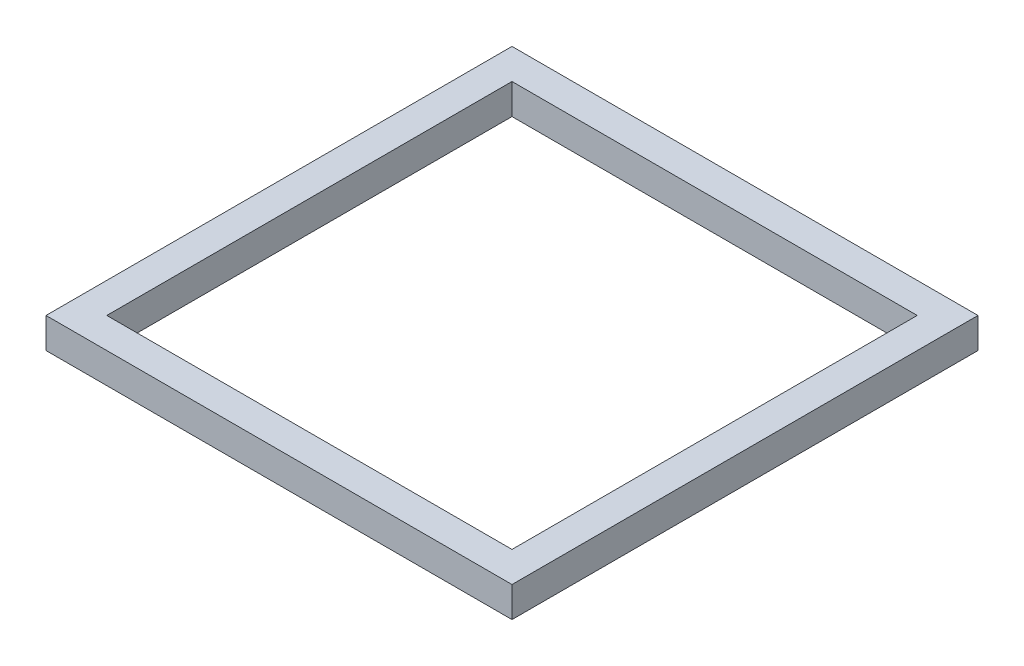
ISO-10303-21;
HEADER;
FILE_DESCRIPTION(('STEP AP214'),'2;1');
FILE_NAME('part.step','',(''),(''),'','','');
FILE_SCHEMA(('AUTOMOTIVE_DESIGN { 1 0 10303 214 1 1 1 1 }'));
ENDSEC;
DATA;
#1=APPLICATION_CONTEXT('core data for automotive mechanical design processes');
#2=APPLICATION_PROTOCOL_DEFINITION('international standard','automotive_design',2000,#1);
#3=PRODUCT_CONTEXT('',#1,'mechanical');
#4=PRODUCT('Part','Part','',(#3));
#5=PRODUCT_RELATED_PRODUCT_CATEGORY('part','',(#4));
#6=PRODUCT_DEFINITION_FORMATION('','',#4);
#7=PRODUCT_DEFINITION_CONTEXT('part definition',#1,'design');
#8=PRODUCT_DEFINITION('design','',#6,#7);
#9=PRODUCT_DEFINITION_SHAPE('','',#8);
#10=(LENGTH_UNIT() NAMED_UNIT(*) SI_UNIT(.MILLI.,.METRE.));
#11=(NAMED_UNIT(*) PLANE_ANGLE_UNIT() SI_UNIT($,.RADIAN.));
#12=(NAMED_UNIT(*) SI_UNIT($,.STERADIAN.) SOLID_ANGLE_UNIT());
#13=UNCERTAINTY_MEASURE_WITH_UNIT(LENGTH_MEASURE(1.E-05),#10,'distance_accuracy_value','');
#14=(GEOMETRIC_REPRESENTATION_CONTEXT(3) GLOBAL_UNCERTAINTY_ASSIGNED_CONTEXT((#13)) GLOBAL_UNIT_ASSIGNED_CONTEXT((#10,
#11,#12)) REPRESENTATION_CONTEXT('',''));
#15=CARTESIAN_POINT('',(0.,0.,0.));
#16=DIRECTION('',(0.,0.,1.));
#17=DIRECTION('',(1.,0.,0.));
#18=AXIS2_PLACEMENT_3D('',#15,#16,#17);
#19=CARTESIAN_POINT('',(0.,3.,0.));
#20=DIRECTION('',(0.,-1.,0.));
#21=DIRECTION('',(0.,0.,-1.));
#22=AXIS2_PLACEMENT_3D('',#19,#20,#21);
#23=PLANE('',#22);
#24=DIRECTION('',(0.,0.,-1.));
#25=VECTOR('',#24,1.);
#26=CARTESIAN_POINT('',(23.,3.,23.));
#27=LINE('',#26,#25);
#28=CARTESIAN_POINT('',(23.,3.,23.));
#29=VERTEX_POINT('',#28);
#30=CARTESIAN_POINT('',(23.,3.,-23.));
#31=VERTEX_POINT('',#30);
#32=EDGE_CURVE('E157',#29,#31,#27,.T.);
#33=ORIENTED_EDGE('',*,*,#32,.T.);
#34=DIRECTION('',(-1.,0.,0.));
#35=VECTOR('',#34,1.);
#36=CARTESIAN_POINT('',(-23.,3.,-23.));
#37=LINE('',#36,#35);
#38=CARTESIAN_POINT('',(-23.,3.,-23.));
#39=VERTEX_POINT('',#38);
#40=EDGE_CURVE('E161',#31,#39,#37,.T.);
#41=ORIENTED_EDGE('',*,*,#40,.T.);
#42=DIRECTION('',(0.,0.,1.));
#43=VECTOR('',#42,1.);
#44=CARTESIAN_POINT('',(-23.,3.,23.));
#45=LINE('',#44,#43);
#46=CARTESIAN_POINT('',(-23.,3.,23.));
#47=VERTEX_POINT('',#46);
#48=EDGE_CURVE('E165',#39,#47,#45,.T.);
#49=ORIENTED_EDGE('',*,*,#48,.T.);
#50=DIRECTION('',(1.,0.,0.));
#51=VECTOR('',#50,1.);
#52=CARTESIAN_POINT('',(-23.,3.,23.));
#53=LINE('',#52,#51);
#54=EDGE_CURVE('E168',#47,#29,#53,.T.);
#55=ORIENTED_EDGE('',*,*,#54,.T.);
#56=EDGE_LOOP('',(#33,#41,#49,#55));
#57=FACE_BOUND('',#56,.T.);
#58=DIRECTION('',(0.,0.,1.));
#59=VECTOR('',#58,1.);
#60=CARTESIAN_POINT('',(-20.,3.,20.));
#61=LINE('',#60,#59);
#62=CARTESIAN_POINT('',(-20.,3.,-20.));
#63=VERTEX_POINT('',#62);
#64=CARTESIAN_POINT('',(-20.,3.,20.));
#65=VERTEX_POINT('',#64);
#66=EDGE_CURVE('E109',#63,#65,#61,.T.);
#67=ORIENTED_EDGE('',*,*,#66,.F.);
#68=DIRECTION('',(-1.,0.,0.));
#69=VECTOR('',#68,1.);
#70=CARTESIAN_POINT('',(20.,3.,-20.));
#71=LINE('',#70,#69);
#72=CARTESIAN_POINT('',(20.,3.,-20.));
#73=VERTEX_POINT('',#72);
#74=EDGE_CURVE('E135',#73,#63,#71,.T.);
#75=ORIENTED_EDGE('',*,*,#74,.F.);
#76=DIRECTION('',(0.,0.,-1.));
#77=VECTOR('',#76,1.);
#78=CARTESIAN_POINT('',(20.,3.,20.));
#79=LINE('',#78,#77);
#80=CARTESIAN_POINT('',(20.,3.,20.));
#81=VERTEX_POINT('',#80);
#82=EDGE_CURVE('E131',#81,#73,#79,.T.);
#83=ORIENTED_EDGE('',*,*,#82,.F.);
#84=DIRECTION('',(1.,0.,0.));
#85=VECTOR('',#84,1.);
#86=CARTESIAN_POINT('',(20.,3.,20.));
#87=LINE('',#86,#85);
#88=EDGE_CURVE('E118',#65,#81,#87,.T.);
#89=ORIENTED_EDGE('',*,*,#88,.F.);
#90=EDGE_LOOP('',(#67,#75,#83,#89));
#91=FACE_BOUND('',#90,.T.);
#92=ADVANCED_FACE('F43',(#57,#91),#23,.F.);
#93=CARTESIAN_POINT('',(0.,0.,0.));
#94=DIRECTION('',(0.,-1.,0.));
#95=DIRECTION('',(0.,0.,-1.));
#96=AXIS2_PLACEMENT_3D('',#93,#94,#95);
#97=PLANE('',#96);
#98=DIRECTION('',(0.,0.,-1.));
#99=VECTOR('',#98,1.);
#100=CARTESIAN_POINT('',(23.,0.,23.));
#101=LINE('',#100,#99);
#102=CARTESIAN_POINT('',(23.,0.,23.));
#103=VERTEX_POINT('',#102);
#104=CARTESIAN_POINT('',(23.,0.,-23.));
#105=VERTEX_POINT('',#104);
#106=EDGE_CURVE('E127',#103,#105,#101,.T.);
#107=ORIENTED_EDGE('',*,*,#106,.F.);
#108=DIRECTION('',(1.,0.,0.));
#109=VECTOR('',#108,1.);
#110=CARTESIAN_POINT('',(-23.,0.,23.));
#111=LINE('',#110,#109);
#112=CARTESIAN_POINT('',(-23.,0.,23.));
#113=VERTEX_POINT('',#112);
#114=EDGE_CURVE('E162',#113,#103,#111,.T.);
#115=ORIENTED_EDGE('',*,*,#114,.F.);
#116=DIRECTION('',(0.,0.,1.));
#117=VECTOR('',#116,1.);
#118=CARTESIAN_POINT('',(-23.,0.,23.));
#119=LINE('',#118,#117);
#120=CARTESIAN_POINT('',(-23.,0.,-23.));
#121=VERTEX_POINT('',#120);
#122=EDGE_CURVE('E178',#121,#113,#119,.T.);
#123=ORIENTED_EDGE('',*,*,#122,.F.);
#124=DIRECTION('',(-1.,0.,0.));
#125=VECTOR('',#124,1.);
#126=CARTESIAN_POINT('',(-23.,0.,-23.));
#127=LINE('',#126,#125);
#128=EDGE_CURVE('E175',#105,#121,#127,.T.);
#129=ORIENTED_EDGE('',*,*,#128,.F.);
#130=EDGE_LOOP('',(#107,#115,#123,#129));
#131=FACE_BOUND('',#130,.T.);
#132=DIRECTION('',(-1.,0.,0.));
#133=VECTOR('',#132,1.);
#134=CARTESIAN_POINT('',(20.,0.,-20.));
#135=LINE('',#134,#133);
#136=CARTESIAN_POINT('',(20.,0.,-20.));
#137=VERTEX_POINT('',#136);
#138=CARTESIAN_POINT('',(-20.,0.,-20.));
#139=VERTEX_POINT('',#138);
#140=EDGE_CURVE('E119',#137,#139,#135,.T.);
#141=ORIENTED_EDGE('',*,*,#140,.T.);
#142=DIRECTION('',(0.,0.,1.));
#143=VECTOR('',#142,1.);
#144=CARTESIAN_POINT('',(-20.,0.,20.));
#145=LINE('',#144,#143);
#146=CARTESIAN_POINT('',(-20.,0.,20.));
#147=VERTEX_POINT('',#146);
#148=EDGE_CURVE('E67',#139,#147,#145,.T.);
#149=ORIENTED_EDGE('',*,*,#148,.T.);
#150=DIRECTION('',(1.,0.,0.));
#151=VECTOR('',#150,1.);
#152=CARTESIAN_POINT('',(20.,0.,20.));
#153=LINE('',#152,#151);
#154=CARTESIAN_POINT('',(20.,0.,20.));
#155=VERTEX_POINT('',#154);
#156=EDGE_CURVE('E125',#147,#155,#153,.T.);
#157=ORIENTED_EDGE('',*,*,#156,.T.);
#158=DIRECTION('',(0.,0.,-1.));
#159=VECTOR('',#158,1.);
#160=CARTESIAN_POINT('',(20.,0.,20.));
#161=LINE('',#160,#159);
#162=EDGE_CURVE('E144',#155,#137,#161,.T.);
#163=ORIENTED_EDGE('',*,*,#162,.T.);
#164=EDGE_LOOP('',(#141,#149,#157,#163));
#165=FACE_BOUND('',#164,.T.);
#166=ADVANCED_FACE('F201',(#131,#165),#97,.T.);
#167=CARTESIAN_POINT('',(23.,3.,23.));
#168=DIRECTION('',(-1.,0.,0.));
#169=DIRECTION('',(0.,0.,1.));
#170=AXIS2_PLACEMENT_3D('',#167,#168,#169);
#171=PLANE('',#170);
#172=ORIENTED_EDGE('',*,*,#106,.T.);
#173=DIRECTION('',(0.,-1.,0.));
#174=VECTOR('',#173,1.);
#175=CARTESIAN_POINT('',(23.,3.,-23.));
#176=LINE('',#175,#174);
#177=EDGE_CURVE('E11',#31,#105,#176,.T.);
#178=ORIENTED_EDGE('',*,*,#177,.F.);
#179=ORIENTED_EDGE('',*,*,#32,.F.);
#180=DIRECTION('',(0.,-1.,0.));
#181=VECTOR('',#180,1.);
#182=CARTESIAN_POINT('',(23.,3.,23.));
#183=LINE('',#182,#181);
#184=EDGE_CURVE('E171',#29,#103,#183,.T.);
#185=ORIENTED_EDGE('',*,*,#184,.T.);
#186=EDGE_LOOP('',(#172,#178,#179,#185));
#187=FACE_BOUND('',#186,.T.);
#188=ADVANCED_FACE('F45',(#187),#171,.F.);
#189=CARTESIAN_POINT('',(-23.,3.,-23.));
#190=DIRECTION('',(0.,0.,1.));
#191=DIRECTION('',(1.,0.,0.));
#192=AXIS2_PLACEMENT_3D('',#189,#190,#191);
#193=PLANE('',#192);
#194=ORIENTED_EDGE('',*,*,#128,.T.);
#195=DIRECTION('',(0.,-1.,0.));
#196=VECTOR('',#195,1.);
#197=CARTESIAN_POINT('',(-23.,3.,-23.));
#198=LINE('',#197,#196);
#199=EDGE_CURVE('E52',#39,#121,#198,.T.);
#200=ORIENTED_EDGE('',*,*,#199,.F.);
#201=ORIENTED_EDGE('',*,*,#40,.F.);
#202=ORIENTED_EDGE('',*,*,#177,.T.);
#203=EDGE_LOOP('',(#194,#200,#201,#202));
#204=FACE_BOUND('',#203,.T.);
#205=ADVANCED_FACE('F211',(#204),#193,.F.);
#206=CARTESIAN_POINT('',(-23.,3.,23.));
#207=DIRECTION('',(1.,0.,0.));
#208=DIRECTION('',(0.,0.,-1.));
#209=AXIS2_PLACEMENT_3D('',#206,#207,#208);
#210=PLANE('',#209);
#211=ORIENTED_EDGE('',*,*,#122,.T.);
#212=DIRECTION('',(0.,-1.,0.));
#213=VECTOR('',#212,1.);
#214=CARTESIAN_POINT('',(-23.,3.,23.));
#215=LINE('',#214,#213);
#216=EDGE_CURVE('E186',#47,#113,#215,.T.);
#217=ORIENTED_EDGE('',*,*,#216,.F.);
#218=ORIENTED_EDGE('',*,*,#48,.F.);
#219=ORIENTED_EDGE('',*,*,#199,.T.);
#220=EDGE_LOOP('',(#211,#217,#218,#219));
#221=FACE_BOUND('',#220,.T.);
#222=ADVANCED_FACE('F195',(#221),#210,.F.);
#223=CARTESIAN_POINT('',(-23.,3.,23.));
#224=DIRECTION('',(0.,0.,-1.));
#225=DIRECTION('',(-1.,0.,0.));
#226=AXIS2_PLACEMENT_3D('',#223,#224,#225);
#227=PLANE('',#226);
#228=ORIENTED_EDGE('',*,*,#114,.T.);
#229=ORIENTED_EDGE('',*,*,#184,.F.);
#230=ORIENTED_EDGE('',*,*,#54,.F.);
#231=ORIENTED_EDGE('',*,*,#216,.T.);
#232=EDGE_LOOP('',(#228,#229,#230,#231));
#233=FACE_BOUND('',#232,.T.);
#234=ADVANCED_FACE('F205',(#233),#227,.F.);
#235=CARTESIAN_POINT('',(-20.,3.,20.));
#236=DIRECTION('',(1.,0.,0.));
#237=DIRECTION('',(0.,0.,-1.));
#238=AXIS2_PLACEMENT_3D('',#235,#236,#237);
#239=PLANE('',#238);
#240=ORIENTED_EDGE('',*,*,#148,.F.);
#241=DIRECTION('',(0.,-1.,0.));
#242=VECTOR('',#241,1.);
#243=CARTESIAN_POINT('',(-20.,3.,-20.));
#244=LINE('',#243,#242);
#245=EDGE_CURVE('E113',#63,#139,#244,.T.);
#246=ORIENTED_EDGE('',*,*,#245,.F.);
#247=ORIENTED_EDGE('',*,*,#66,.T.);
#248=DIRECTION('',(0.,-1.,0.));
#249=VECTOR('',#248,1.);
#250=CARTESIAN_POINT('',(-20.,3.,20.));
#251=LINE('',#250,#249);
#252=EDGE_CURVE('E112',#65,#147,#251,.T.);
#253=ORIENTED_EDGE('',*,*,#252,.T.);
#254=EDGE_LOOP('',(#240,#246,#247,#253));
#255=FACE_BOUND('',#254,.T.);
#256=ADVANCED_FACE('F111',(#255),#239,.T.);
#257=CARTESIAN_POINT('',(20.,3.,20.));
#258=DIRECTION('',(0.,0.,-1.));
#259=DIRECTION('',(-1.,0.,0.));
#260=AXIS2_PLACEMENT_3D('',#257,#258,#259);
#261=PLANE('',#260);
#262=ORIENTED_EDGE('',*,*,#156,.F.);
#263=ORIENTED_EDGE('',*,*,#252,.F.);
#264=ORIENTED_EDGE('',*,*,#88,.T.);
#265=DIRECTION('',(0.,-1.,0.));
#266=VECTOR('',#265,1.);
#267=CARTESIAN_POINT('',(20.,3.,20.));
#268=LINE('',#267,#266);
#269=EDGE_CURVE('E128',#81,#155,#268,.T.);
#270=ORIENTED_EDGE('',*,*,#269,.T.);
#271=EDGE_LOOP('',(#262,#263,#264,#270));
#272=FACE_BOUND('',#271,.T.);
#273=ADVANCED_FACE('F122',(#272),#261,.T.);
#274=CARTESIAN_POINT('',(20.,3.,20.));
#275=DIRECTION('',(-1.,0.,0.));
#276=DIRECTION('',(0.,0.,1.));
#277=AXIS2_PLACEMENT_3D('',#274,#275,#276);
#278=PLANE('',#277);
#279=ORIENTED_EDGE('',*,*,#162,.F.);
#280=ORIENTED_EDGE('',*,*,#269,.F.);
#281=ORIENTED_EDGE('',*,*,#82,.T.);
#282=DIRECTION('',(0.,-1.,0.));
#283=VECTOR('',#282,1.);
#284=CARTESIAN_POINT('',(20.,3.,-20.));
#285=LINE('',#284,#283);
#286=EDGE_CURVE('E59',#73,#137,#285,.T.);
#287=ORIENTED_EDGE('',*,*,#286,.T.);
#288=EDGE_LOOP('',(#279,#280,#281,#287));
#289=FACE_BOUND('',#288,.T.);
#290=ADVANCED_FACE('F234',(#289),#278,.T.);
#291=CARTESIAN_POINT('',(20.,3.,-20.));
#292=DIRECTION('',(0.,0.,1.));
#293=DIRECTION('',(1.,0.,0.));
#294=AXIS2_PLACEMENT_3D('',#291,#292,#293);
#295=PLANE('',#294);
#296=ORIENTED_EDGE('',*,*,#140,.F.);
#297=ORIENTED_EDGE('',*,*,#286,.F.);
#298=ORIENTED_EDGE('',*,*,#74,.T.);
#299=ORIENTED_EDGE('',*,*,#245,.T.);
#300=EDGE_LOOP('',(#296,#297,#298,#299));
#301=FACE_BOUND('',#300,.T.);
#302=ADVANCED_FACE('F238',(#301),#295,.T.);
#303=CLOSED_SHELL('',(#92,#166,#188,#205,#222,#234,#256,#273,#290,#302));
#304=MANIFOLD_SOLID_BREP('B2',#303);
#305=ADVANCED_BREP_SHAPE_REPRESENTATION('',(#18,#304),#14);
#306=SHAPE_DEFINITION_REPRESENTATION(#9,#305);
ENDSEC;
END-ISO-10303-21;
